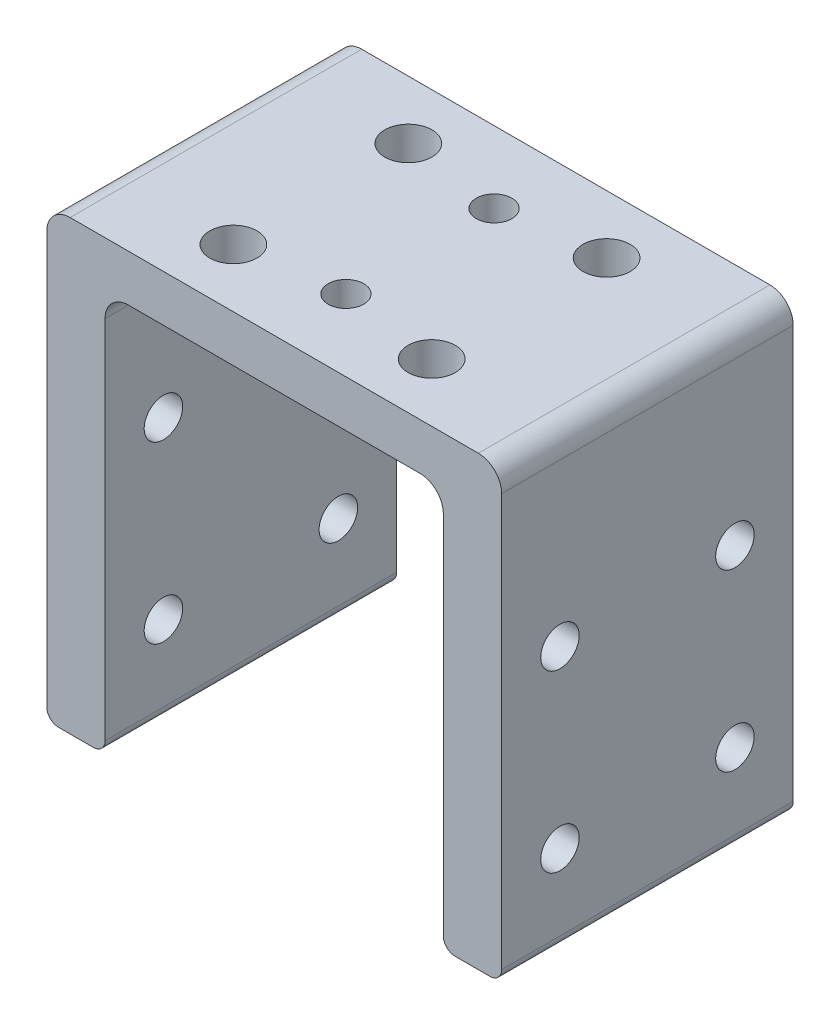
ISO-10303-21;
HEADER;
FILE_DESCRIPTION(('STEP AP214'),'2;1');
FILE_NAME('part.step','',(''),(''),'','','');
FILE_SCHEMA(('AUTOMOTIVE_DESIGN { 1 0 10303 214 1 1 1 1 }'));
ENDSEC;
DATA;
#1=APPLICATION_CONTEXT('core data for automotive mechanical design processes');
#2=APPLICATION_PROTOCOL_DEFINITION('international standard','automotive_design',2000,#1);
#3=PRODUCT_CONTEXT('',#1,'mechanical');
#4=PRODUCT('Part','Part','',(#3));
#5=PRODUCT_RELATED_PRODUCT_CATEGORY('part','',(#4));
#6=PRODUCT_DEFINITION_FORMATION('','',#4);
#7=PRODUCT_DEFINITION_CONTEXT('part definition',#1,'design');
#8=PRODUCT_DEFINITION('design','',#6,#7);
#9=PRODUCT_DEFINITION_SHAPE('','',#8);
#10=(LENGTH_UNIT() NAMED_UNIT(*) SI_UNIT(.MILLI.,.METRE.));
#11=(NAMED_UNIT(*) PLANE_ANGLE_UNIT() SI_UNIT($,.RADIAN.));
#12=(NAMED_UNIT(*) SI_UNIT($,.STERADIAN.) SOLID_ANGLE_UNIT());
#13=UNCERTAINTY_MEASURE_WITH_UNIT(LENGTH_MEASURE(1.E-05),#10,'distance_accuracy_value','');
#14=(GEOMETRIC_REPRESENTATION_CONTEXT(3) GLOBAL_UNCERTAINTY_ASSIGNED_CONTEXT((#13)) GLOBAL_UNIT_ASSIGNED_CONTEXT((#10,
#11,#12)) REPRESENTATION_CONTEXT('',''));
#15=CARTESIAN_POINT('',(0.,0.,0.));
#16=DIRECTION('',(0.,0.,1.));
#17=DIRECTION('',(1.,0.,0.));
#18=AXIS2_PLACEMENT_3D('',#15,#16,#17);
#19=CARTESIAN_POINT('',(19.5,-24.5,25.));
#20=DIRECTION('',(-1.,0.,0.));
#21=DIRECTION('',(0.,0.,1.));
#22=AXIS2_PLACEMENT_3D('',#19,#20,#21);
#23=PLANE('',#22);
#24=CARTESIAN_POINT('',(19.5,8.65000000000001,5.));
#25=DIRECTION('',(-1.,0.,0.));
#26=DIRECTION('',(0.,0.,1.));
#27=AXIS2_PLACEMENT_3D('',#24,#25,#26);
#28=CIRCLE('',#27,1.64999999999999);
#29=CARTESIAN_POINT('',(19.5,8.65000000000001,6.64999999999999));
#30=VERTEX_POINT('',#29);
#31=EDGE_CURVE('E250',#30,#30,#28,.T.);
#32=ORIENTED_EDGE('',*,*,#31,.T.);
#33=EDGE_LOOP('',(#32));
#34=FACE_BOUND('',#33,.T.);
#35=CARTESIAN_POINT('',(19.5,8.65000000000001,20.));
#36=DIRECTION('',(-1.,0.,0.));
#37=DIRECTION('',(0.,0.,1.));
#38=AXIS2_PLACEMENT_3D('',#35,#36,#37);
#39=CIRCLE('',#38,1.64999999999999);
#40=CARTESIAN_POINT('',(19.5,8.65000000000001,21.65));
#41=VERTEX_POINT('',#40);
#42=EDGE_CURVE('E244',#41,#41,#39,.T.);
#43=ORIENTED_EDGE('',*,*,#42,.T.);
#44=EDGE_LOOP('',(#43));
#45=FACE_BOUND('',#44,.T.);
#46=CARTESIAN_POINT('',(19.5,-6.34999999999999,20.));
#47=DIRECTION('',(-1.,0.,0.));
#48=DIRECTION('',(0.,0.,1.));
#49=AXIS2_PLACEMENT_3D('',#46,#47,#48);
#50=CIRCLE('',#49,1.64999999999999);
#51=CARTESIAN_POINT('',(19.5,-6.34999999999999,21.65));
#52=VERTEX_POINT('',#51);
#53=EDGE_CURVE('E238',#52,#52,#50,.T.);
#54=ORIENTED_EDGE('',*,*,#53,.T.);
#55=EDGE_LOOP('',(#54));
#56=FACE_BOUND('',#55,.T.);
#57=CARTESIAN_POINT('',(19.5,-6.34999999999999,5.));
#58=DIRECTION('',(-1.,0.,0.));
#59=DIRECTION('',(0.,0.,1.));
#60=AXIS2_PLACEMENT_3D('',#57,#58,#59);
#61=CIRCLE('',#60,1.64999999999999);
#62=CARTESIAN_POINT('',(19.5,-6.34999999999999,6.64999999999999));
#63=VERTEX_POINT('',#62);
#64=EDGE_CURVE('E232',#63,#63,#61,.T.);
#65=ORIENTED_EDGE('',*,*,#64,.T.);
#66=EDGE_LOOP('',(#65));
#67=FACE_BOUND('',#66,.T.);
#68=DIRECTION('',(0.,1.,0.));
#69=VECTOR('',#68,1.);
#70=CARTESIAN_POINT('',(19.5,-24.5,25.));
#71=LINE('',#70,#69);
#72=CARTESIAN_POINT('',(19.5,-12.85,25.));
#73=VERTEX_POINT('',#72);
#74=CARTESIAN_POINT('',(19.5,22.5,25.));
#75=VERTEX_POINT('',#74);
#76=EDGE_CURVE('E206',#73,#75,#71,.T.);
#77=ORIENTED_EDGE('',*,*,#76,.F.);
#78=DIRECTION('',(0.,0.,1.));
#79=VECTOR('',#78,1.);
#80=CARTESIAN_POINT('',(19.5,-12.85,25.));
#81=LINE('',#80,#79);
#82=CARTESIAN_POINT('',(19.5,-12.85,0.));
#83=VERTEX_POINT('',#82);
#84=EDGE_CURVE('E11',#73,#83,#81,.F.);
#85=ORIENTED_EDGE('',*,*,#84,.T.);
#86=DIRECTION('',(0.,1.,0.));
#87=VECTOR('',#86,1.);
#88=CARTESIAN_POINT('',(19.5,-24.5,0.));
#89=LINE('',#88,#87);
#90=CARTESIAN_POINT('',(19.5,22.5,0.));
#91=VERTEX_POINT('',#90);
#92=EDGE_CURVE('E217',#83,#91,#89,.T.);
#93=ORIENTED_EDGE('',*,*,#92,.T.);
#94=DIRECTION('',(0.,0.,-1.));
#95=VECTOR('',#94,1.);
#96=CARTESIAN_POINT('',(19.5,22.5,25.));
#97=LINE('',#96,#95);
#98=EDGE_CURVE('E273',#91,#75,#97,.F.);
#99=ORIENTED_EDGE('',*,*,#98,.T.);
#100=EDGE_LOOP('',(#77,#85,#93,#99));
#101=FACE_BOUND('',#100,.T.);
#102=ADVANCED_FACE('F44',(#34,#45,#56,#67,#101),#23,.F.);
#103=CARTESIAN_POINT('',(-19.5,24.5,25.));
#104=DIRECTION('',(0.,-1.,0.));
#105=DIRECTION('',(0.,0.,-1.));
#106=AXIS2_PLACEMENT_3D('',#103,#104,#105);
#107=PLANE('',#106);
#108=CARTESIAN_POINT('',(0.,24.5,6.15));
#109=DIRECTION('',(0.,1.,0.));
#110=DIRECTION('',(0.,0.,1.));
#111=AXIS2_PLACEMENT_3D('',#108,#109,#110);
#112=CIRCLE('',#111,1.525);
#113=CARTESIAN_POINT('',(0.,24.5,7.675));
#114=VERTEX_POINT('',#113);
#115=EDGE_CURVE('E340',#114,#114,#112,.T.);
#116=ORIENTED_EDGE('',*,*,#115,.F.);
#117=EDGE_LOOP('',(#116));
#118=FACE_BOUND('',#117,.T.);
#119=CARTESIAN_POINT('',(0.,24.5,18.85));
#120=DIRECTION('',(0.,1.,0.));
#121=DIRECTION('',(0.,0.,1.));
#122=AXIS2_PLACEMENT_3D('',#119,#120,#121);
#123=CIRCLE('',#122,1.525);
#124=CARTESIAN_POINT('',(0.,24.5,20.375));
#125=VERTEX_POINT('',#124);
#126=EDGE_CURVE('E350',#125,#125,#123,.T.);
#127=ORIENTED_EDGE('',*,*,#126,.F.);
#128=EDGE_LOOP('',(#127));
#129=FACE_BOUND('',#128,.T.);
#130=CARTESIAN_POINT('',(8.49999999999999,24.5,20.));
#131=DIRECTION('',(0.,-1.,0.));
#132=DIRECTION('',(0.,0.,-1.));
#133=AXIS2_PLACEMENT_3D('',#130,#131,#132);
#134=CIRCLE('',#133,2.025);
#135=CARTESIAN_POINT('',(8.49999999999999,24.5,17.975));
#136=VERTEX_POINT('',#135);
#137=EDGE_CURVE('E387',#136,#136,#134,.T.);
#138=ORIENTED_EDGE('',*,*,#137,.T.);
#139=EDGE_LOOP('',(#138));
#140=FACE_BOUND('',#139,.T.);
#141=CARTESIAN_POINT('',(8.49999999999999,24.5,5.));
#142=DIRECTION('',(0.,-1.,0.));
#143=DIRECTION('',(0.,0.,-1.));
#144=AXIS2_PLACEMENT_3D('',#141,#142,#143);
#145=CIRCLE('',#144,2.025);
#146=CARTESIAN_POINT('',(8.49999999999999,24.5,2.975));
#147=VERTEX_POINT('',#146);
#148=EDGE_CURVE('E383',#147,#147,#145,.T.);
#149=ORIENTED_EDGE('',*,*,#148,.T.);
#150=EDGE_LOOP('',(#149));
#151=FACE_BOUND('',#150,.T.);
#152=CARTESIAN_POINT('',(-8.50000000000001,24.5,5.));
#153=DIRECTION('',(0.,-1.,0.));
#154=DIRECTION('',(0.,0.,-1.));
#155=AXIS2_PLACEMENT_3D('',#152,#153,#154);
#156=CIRCLE('',#155,2.025);
#157=CARTESIAN_POINT('',(-8.50000000000001,24.5,2.975));
#158=VERTEX_POINT('',#157);
#159=EDGE_CURVE('E379',#158,#158,#156,.T.);
#160=ORIENTED_EDGE('',*,*,#159,.T.);
#161=EDGE_LOOP('',(#160));
#162=FACE_BOUND('',#161,.T.);
#163=CARTESIAN_POINT('',(-8.50000000000001,24.5,20.));
#164=DIRECTION('',(0.,-1.,0.));
#165=DIRECTION('',(0.,0.,-1.));
#166=AXIS2_PLACEMENT_3D('',#163,#164,#165);
#167=CIRCLE('',#166,2.025);
#168=CARTESIAN_POINT('',(-8.50000000000001,24.5,17.975));
#169=VERTEX_POINT('',#168);
#170=EDGE_CURVE('E375',#169,#169,#167,.T.);
#171=ORIENTED_EDGE('',*,*,#170,.T.);
#172=EDGE_LOOP('',(#171));
#173=FACE_BOUND('',#172,.T.);
#174=DIRECTION('',(-1.,0.,0.));
#175=VECTOR('',#174,1.);
#176=CARTESIAN_POINT('',(-19.5,24.5,25.));
#177=LINE('',#176,#175);
#178=CARTESIAN_POINT('',(17.5,24.5,25.));
#179=VERTEX_POINT('',#178);
#180=CARTESIAN_POINT('',(-17.5,24.5,25.));
#181=VERTEX_POINT('',#180);
#182=EDGE_CURVE('E209',#179,#181,#177,.T.);
#183=ORIENTED_EDGE('',*,*,#182,.F.);
#184=DIRECTION('',(0.,0.,-1.));
#185=VECTOR('',#184,1.);
#186=CARTESIAN_POINT('',(17.5,24.5,25.));
#187=LINE('',#186,#185);
#188=CARTESIAN_POINT('',(17.5,24.5,0.));
#189=VERTEX_POINT('',#188);
#190=EDGE_CURVE('E262',#179,#189,#187,.T.);
#191=ORIENTED_EDGE('',*,*,#190,.T.);
#192=DIRECTION('',(-1.,0.,0.));
#193=VECTOR('',#192,1.);
#194=CARTESIAN_POINT('',(-19.5,24.5,0.));
#195=LINE('',#194,#193);
#196=CARTESIAN_POINT('',(-17.5,24.5,0.));
#197=VERTEX_POINT('',#196);
#198=EDGE_CURVE('E220',#189,#197,#195,.T.);
#199=ORIENTED_EDGE('',*,*,#198,.T.);
#200=DIRECTION('',(0.,0.,-1.));
#201=VECTOR('',#200,1.);
#202=CARTESIAN_POINT('',(-17.5,24.5,25.));
#203=LINE('',#202,#201);
#204=EDGE_CURVE('E259',#197,#181,#203,.F.);
#205=ORIENTED_EDGE('',*,*,#204,.T.);
#206=EDGE_LOOP('',(#183,#191,#199,#205));
#207=FACE_BOUND('',#206,.T.);
#208=ADVANCED_FACE('F479',(#118,#129,#140,#151,#162,#173,#207),#107,.F.);
#209=CARTESIAN_POINT('',(-19.5,-24.5,25.));
#210=DIRECTION('',(1.,0.,0.));
#211=DIRECTION('',(0.,0.,-1.));
#212=AXIS2_PLACEMENT_3D('',#209,#210,#211);
#213=PLANE('',#212);
#214=CARTESIAN_POINT('',(-19.5,8.65000000000001,5.));
#215=DIRECTION('',(-1.,0.,0.));
#216=DIRECTION('',(0.,0.,1.));
#217=AXIS2_PLACEMENT_3D('',#214,#215,#216);
#218=CIRCLE('',#217,1.64999999999999);
#219=CARTESIAN_POINT('',(-19.5,8.65000000000001,6.64999999999999));
#220=VERTEX_POINT('',#219);
#221=EDGE_CURVE('E395',#220,#220,#218,.T.);
#222=ORIENTED_EDGE('',*,*,#221,.F.);
#223=EDGE_LOOP('',(#222));
#224=FACE_BOUND('',#223,.T.);
#225=CARTESIAN_POINT('',(-19.5,8.65000000000001,20.));
#226=DIRECTION('',(-1.,0.,0.));
#227=DIRECTION('',(0.,0.,1.));
#228=AXIS2_PLACEMENT_3D('',#225,#226,#227);
#229=CIRCLE('',#228,1.64999999999999);
#230=CARTESIAN_POINT('',(-19.5,8.65000000000001,21.65));
#231=VERTEX_POINT('',#230);
#232=EDGE_CURVE('E410',#231,#231,#229,.T.);
#233=ORIENTED_EDGE('',*,*,#232,.F.);
#234=EDGE_LOOP('',(#233));
#235=FACE_BOUND('',#234,.T.);
#236=CARTESIAN_POINT('',(-19.5,-6.34999999999999,20.));
#237=DIRECTION('',(-1.,0.,0.));
#238=DIRECTION('',(0.,0.,1.));
#239=AXIS2_PLACEMENT_3D('',#236,#237,#238);
#240=CIRCLE('',#239,1.64999999999999);
#241=CARTESIAN_POINT('',(-19.5,-6.34999999999999,21.65));
#242=VERTEX_POINT('',#241);
#243=EDGE_CURVE('E420',#242,#242,#240,.T.);
#244=ORIENTED_EDGE('',*,*,#243,.F.);
#245=EDGE_LOOP('',(#244));
#246=FACE_BOUND('',#245,.T.);
#247=CARTESIAN_POINT('',(-19.5,-6.34999999999999,5.));
#248=DIRECTION('',(-1.,0.,0.));
#249=DIRECTION('',(0.,0.,1.));
#250=AXIS2_PLACEMENT_3D('',#247,#248,#249);
#251=CIRCLE('',#250,1.64999999999999);
#252=CARTESIAN_POINT('',(-19.5,-6.34999999999999,6.64999999999999));
#253=VERTEX_POINT('',#252);
#254=EDGE_CURVE('E430',#253,#253,#251,.T.);
#255=ORIENTED_EDGE('',*,*,#254,.F.);
#256=EDGE_LOOP('',(#255));
#257=FACE_BOUND('',#256,.T.);
#258=DIRECTION('',(0.,-1.,0.));
#259=VECTOR('',#258,1.);
#260=CARTESIAN_POINT('',(-19.5,-24.5,0.));
#261=LINE('',#260,#259);
#262=CARTESIAN_POINT('',(-19.5,22.5,0.));
#263=VERTEX_POINT('',#262);
#264=CARTESIAN_POINT('',(-19.5,-12.85,0.));
#265=VERTEX_POINT('',#264);
#266=EDGE_CURVE('E210',#263,#265,#261,.T.);
#267=ORIENTED_EDGE('',*,*,#266,.T.);
#268=DIRECTION('',(0.,0.,1.));
#269=VECTOR('',#268,1.);
#270=CARTESIAN_POINT('',(-19.5,-12.85,25.));
#271=LINE('',#270,#269);
#272=CARTESIAN_POINT('',(-19.5,-12.85,25.));
#273=VERTEX_POINT('',#272);
#274=EDGE_CURVE('E293',#265,#273,#271,.T.);
#275=ORIENTED_EDGE('',*,*,#274,.T.);
#276=DIRECTION('',(0.,-1.,0.));
#277=VECTOR('',#276,1.);
#278=CARTESIAN_POINT('',(-19.5,-24.5,25.));
#279=LINE('',#278,#277);
#280=CARTESIAN_POINT('',(-19.5,22.5,25.));
#281=VERTEX_POINT('',#280);
#282=EDGE_CURVE('E214',#281,#273,#279,.T.);
#283=ORIENTED_EDGE('',*,*,#282,.F.);
#284=DIRECTION('',(0.,0.,-1.));
#285=VECTOR('',#284,1.);
#286=CARTESIAN_POINT('',(-19.5,22.5,25.));
#287=LINE('',#286,#285);
#288=EDGE_CURVE('E174',#281,#263,#287,.T.);
#289=ORIENTED_EDGE('',*,*,#288,.T.);
#290=EDGE_LOOP('',(#267,#275,#283,#289));
#291=FACE_BOUND('',#290,.T.);
#292=ADVANCED_FACE('F485',(#224,#235,#246,#257,#291),#213,.F.);
#293=CARTESIAN_POINT('',(0.,0.,25.));
#294=DIRECTION('',(0.,0.,-1.));
#295=DIRECTION('',(-1.,0.,0.));
#296=AXIS2_PLACEMENT_3D('',#293,#294,#295);
#297=PLANE('',#296);
#298=ORIENTED_EDGE('',*,*,#282,.T.);
#299=CARTESIAN_POINT('',(-18.5,-12.85,25.));
#300=DIRECTION('',(0.,0.,-1.));
#301=DIRECTION('',(-1.,0.,0.));
#302=AXIS2_PLACEMENT_3D('',#299,#300,#301);
#303=CIRCLE('',#302,1.);
#304=CARTESIAN_POINT('',(-18.5,-13.85,25.));
#305=VERTEX_POINT('',#304);
#306=EDGE_CURVE('E306',#273,#305,#303,.F.);
#307=ORIENTED_EDGE('',*,*,#306,.T.);
#308=DIRECTION('',(-1.,0.,0.));
#309=VECTOR('',#308,1.);
#310=CARTESIAN_POINT('',(-19.5,-13.85,25.));
#311=LINE('',#310,#309);
#312=CARTESIAN_POINT('',(-15.5,-13.85,25.));
#313=VERTEX_POINT('',#312);
#314=EDGE_CURVE('E391',#313,#305,#311,.T.);
#315=ORIENTED_EDGE('',*,*,#314,.F.);
#316=CARTESIAN_POINT('',(-15.5,-12.85,25.));
#317=DIRECTION('',(0.,0.,-1.));
#318=DIRECTION('',(-1.,0.,0.));
#319=AXIS2_PLACEMENT_3D('',#316,#317,#318);
#320=CIRCLE('',#319,1.);
#321=CARTESIAN_POINT('',(-14.5,-12.85,25.));
#322=VERTEX_POINT('',#321);
#323=EDGE_CURVE('E303',#313,#322,#320,.F.);
#324=ORIENTED_EDGE('',*,*,#323,.T.);
#325=DIRECTION('',(0.,-1.,0.));
#326=VECTOR('',#325,1.);
#327=CARTESIAN_POINT('',(-14.5,-24.5,25.));
#328=LINE('',#327,#326);
#329=CARTESIAN_POINT('',(-14.5,18.5,25.));
#330=VERTEX_POINT('',#329);
#331=EDGE_CURVE('E192',#330,#322,#328,.T.);
#332=ORIENTED_EDGE('',*,*,#331,.F.);
#333=CARTESIAN_POINT('',(-12.5,18.5,25.));
#334=DIRECTION('',(0.,0.,-1.));
#335=DIRECTION('',(-1.,0.,0.));
#336=AXIS2_PLACEMENT_3D('',#333,#334,#335);
#337=CIRCLE('',#336,2.);
#338=CARTESIAN_POINT('',(-12.5,20.5,25.));
#339=VERTEX_POINT('',#338);
#340=EDGE_CURVE('E190',#330,#339,#337,.T.);
#341=ORIENTED_EDGE('',*,*,#340,.T.);
#342=DIRECTION('',(-1.,0.,0.));
#343=VECTOR('',#342,1.);
#344=CARTESIAN_POINT('',(-14.5,20.5,25.));
#345=LINE('',#344,#343);
#346=CARTESIAN_POINT('',(12.5,20.5,25.));
#347=VERTEX_POINT('',#346);
#348=EDGE_CURVE('E180',#347,#339,#345,.T.);
#349=ORIENTED_EDGE('',*,*,#348,.F.);
#350=CARTESIAN_POINT('',(12.5,18.5,25.));
#351=DIRECTION('',(0.,0.,-1.));
#352=DIRECTION('',(-1.,0.,0.));
#353=AXIS2_PLACEMENT_3D('',#350,#351,#352);
#354=CIRCLE('',#353,2.);
#355=CARTESIAN_POINT('',(14.5,18.5,25.));
#356=VERTEX_POINT('',#355);
#357=EDGE_CURVE('E162',#347,#356,#354,.T.);
#358=ORIENTED_EDGE('',*,*,#357,.T.);
#359=DIRECTION('',(0.,1.,0.));
#360=VECTOR('',#359,1.);
#361=CARTESIAN_POINT('',(14.5,20.5,25.));
#362=LINE('',#361,#360);
#363=CARTESIAN_POINT('',(14.5,-12.85,25.));
#364=VERTEX_POINT('',#363);
#365=EDGE_CURVE('E193',#364,#356,#362,.T.);
#366=ORIENTED_EDGE('',*,*,#365,.F.);
#367=CARTESIAN_POINT('',(15.5,-12.85,25.));
#368=DIRECTION('',(0.,0.,-1.));
#369=DIRECTION('',(-1.,0.,0.));
#370=AXIS2_PLACEMENT_3D('',#367,#368,#369);
#371=CIRCLE('',#370,1.);
#372=CARTESIAN_POINT('',(15.5,-13.85,25.));
#373=VERTEX_POINT('',#372);
#374=EDGE_CURVE('E300',#364,#373,#371,.F.);
#375=ORIENTED_EDGE('',*,*,#374,.T.);
#376=CARTESIAN_POINT('',(18.5,-13.85,25.));
#377=VERTEX_POINT('',#376);
#378=EDGE_CURVE('E397',#377,#373,#311,.T.);
#379=ORIENTED_EDGE('',*,*,#378,.F.);
#380=CARTESIAN_POINT('',(18.5,-12.85,25.));
#381=DIRECTION('',(0.,0.,-1.));
#382=DIRECTION('',(-1.,0.,0.));
#383=AXIS2_PLACEMENT_3D('',#380,#381,#382);
#384=CIRCLE('',#383,1.);
#385=EDGE_CURVE('E297',#377,#73,#384,.F.);
#386=ORIENTED_EDGE('',*,*,#385,.T.);
#387=ORIENTED_EDGE('',*,*,#76,.T.);
#388=CARTESIAN_POINT('',(17.5,22.5,25.));
#389=DIRECTION('',(0.,0.,-1.));
#390=DIRECTION('',(-1.,0.,0.));
#391=AXIS2_PLACEMENT_3D('',#388,#389,#390);
#392=CIRCLE('',#391,2.);
#393=EDGE_CURVE('E280',#75,#179,#392,.F.);
#394=ORIENTED_EDGE('',*,*,#393,.T.);
#395=ORIENTED_EDGE('',*,*,#182,.T.);
#396=CARTESIAN_POINT('',(-17.5,22.5,25.));
#397=DIRECTION('',(0.,0.,-1.));
#398=DIRECTION('',(-1.,0.,0.));
#399=AXIS2_PLACEMENT_3D('',#396,#397,#398);
#400=CIRCLE('',#399,2.);
#401=EDGE_CURVE('E277',#181,#281,#400,.F.);
#402=ORIENTED_EDGE('',*,*,#401,.T.);
#403=EDGE_LOOP('',(#298,#307,#315,#324,#332,#341,#349,#358,#366,#375,#379,#386,#387,#394,#395,#402));
#404=FACE_BOUND('',#403,.T.);
#405=ADVANCED_FACE('F188',(#404),#297,.F.);
#406=CARTESIAN_POINT('',(0.,0.,0.));
#407=DIRECTION('',(0.,0.,-1.));
#408=DIRECTION('',(-1.,0.,0.));
#409=AXIS2_PLACEMENT_3D('',#406,#407,#408);
#410=PLANE('',#409);
#411=DIRECTION('',(-1.,0.,0.));
#412=VECTOR('',#411,1.);
#413=CARTESIAN_POINT('',(-19.5,-13.85,0.));
#414=LINE('',#413,#412);
#415=CARTESIAN_POINT('',(-15.5,-13.85,0.));
#416=VERTEX_POINT('',#415);
#417=CARTESIAN_POINT('',(-18.5,-13.85,0.));
#418=VERTEX_POINT('',#417);
#419=EDGE_CURVE('E396',#416,#418,#414,.T.);
#420=ORIENTED_EDGE('',*,*,#419,.T.);
#421=CARTESIAN_POINT('',(-18.5,-12.85,0.));
#422=DIRECTION('',(0.,0.,-1.));
#423=DIRECTION('',(-1.,0.,0.));
#424=AXIS2_PLACEMENT_3D('',#421,#422,#423);
#425=CIRCLE('',#424,1.);
#426=EDGE_CURVE('E322',#418,#265,#425,.T.);
#427=ORIENTED_EDGE('',*,*,#426,.T.);
#428=ORIENTED_EDGE('',*,*,#266,.F.);
#429=CARTESIAN_POINT('',(-17.5,22.5,0.));
#430=DIRECTION('',(0.,0.,-1.));
#431=DIRECTION('',(-1.,0.,0.));
#432=AXIS2_PLACEMENT_3D('',#429,#430,#431);
#433=CIRCLE('',#432,2.);
#434=EDGE_CURVE('E266',#263,#197,#433,.T.);
#435=ORIENTED_EDGE('',*,*,#434,.T.);
#436=ORIENTED_EDGE('',*,*,#198,.F.);
#437=CARTESIAN_POINT('',(17.5,22.5,0.));
#438=DIRECTION('',(0.,0.,-1.));
#439=DIRECTION('',(-1.,0.,0.));
#440=AXIS2_PLACEMENT_3D('',#437,#438,#439);
#441=CIRCLE('',#440,2.);
#442=EDGE_CURVE('E269',#189,#91,#441,.T.);
#443=ORIENTED_EDGE('',*,*,#442,.T.);
#444=ORIENTED_EDGE('',*,*,#92,.F.);
#445=CARTESIAN_POINT('',(18.5,-12.85,0.));
#446=DIRECTION('',(0.,0.,-1.));
#447=DIRECTION('',(-1.,0.,0.));
#448=AXIS2_PLACEMENT_3D('',#445,#446,#447);
#449=CIRCLE('',#448,1.);
#450=CARTESIAN_POINT('',(18.5,-13.85,0.));
#451=VERTEX_POINT('',#450);
#452=EDGE_CURVE('E315',#83,#451,#449,.T.);
#453=ORIENTED_EDGE('',*,*,#452,.T.);
#454=CARTESIAN_POINT('',(15.5,-13.85,0.));
#455=VERTEX_POINT('',#454);
#456=EDGE_CURVE('E392',#451,#455,#414,.T.);
#457=ORIENTED_EDGE('',*,*,#456,.T.);
#458=CARTESIAN_POINT('',(15.5,-12.85,0.));
#459=DIRECTION('',(0.,0.,-1.));
#460=DIRECTION('',(-1.,0.,0.));
#461=AXIS2_PLACEMENT_3D('',#458,#459,#460);
#462=CIRCLE('',#461,1.);
#463=CARTESIAN_POINT('',(14.5,-12.85,0.));
#464=VERTEX_POINT('',#463);
#465=EDGE_CURVE('E70',#455,#464,#462,.T.);
#466=ORIENTED_EDGE('',*,*,#465,.T.);
#467=DIRECTION('',(0.,1.,0.));
#468=VECTOR('',#467,1.);
#469=CARTESIAN_POINT('',(14.5,20.5,0.));
#470=LINE('',#469,#468);
#471=CARTESIAN_POINT('',(14.5,18.5,0.));
#472=VERTEX_POINT('',#471);
#473=EDGE_CURVE('E200',#464,#472,#470,.T.);
#474=ORIENTED_EDGE('',*,*,#473,.T.);
#475=CARTESIAN_POINT('',(12.5,18.5,0.));
#476=DIRECTION('',(0.,0.,-1.));
#477=DIRECTION('',(-1.,0.,0.));
#478=AXIS2_PLACEMENT_3D('',#475,#476,#477);
#479=CIRCLE('',#478,2.);
#480=CARTESIAN_POINT('',(12.5,20.5,0.));
#481=VERTEX_POINT('',#480);
#482=EDGE_CURVE('E173',#472,#481,#479,.F.);
#483=ORIENTED_EDGE('',*,*,#482,.T.);
#484=DIRECTION('',(-1.,0.,0.));
#485=VECTOR('',#484,1.);
#486=CARTESIAN_POINT('',(-14.5,20.5,0.));
#487=LINE('',#486,#485);
#488=CARTESIAN_POINT('',(-12.5,20.5,0.));
#489=VERTEX_POINT('',#488);
#490=EDGE_CURVE('E183',#481,#489,#487,.T.);
#491=ORIENTED_EDGE('',*,*,#490,.T.);
#492=CARTESIAN_POINT('',(-12.5,18.5,0.));
#493=DIRECTION('',(0.,0.,-1.));
#494=DIRECTION('',(-1.,0.,0.));
#495=AXIS2_PLACEMENT_3D('',#492,#493,#494);
#496=CIRCLE('',#495,2.);
#497=CARTESIAN_POINT('',(-14.5,18.5,0.));
#498=VERTEX_POINT('',#497);
#499=EDGE_CURVE('E290',#489,#498,#496,.F.);
#500=ORIENTED_EDGE('',*,*,#499,.T.);
#501=DIRECTION('',(0.,-1.,0.));
#502=VECTOR('',#501,1.);
#503=CARTESIAN_POINT('',(-14.5,-24.5,0.));
#504=LINE('',#503,#502);
#505=CARTESIAN_POINT('',(-14.5,-12.85,0.));
#506=VERTEX_POINT('',#505);
#507=EDGE_CURVE('E221',#498,#506,#504,.T.);
#508=ORIENTED_EDGE('',*,*,#507,.T.);
#509=CARTESIAN_POINT('',(-15.5,-12.85,0.));
#510=DIRECTION('',(0.,0.,-1.));
#511=DIRECTION('',(-1.,0.,0.));
#512=AXIS2_PLACEMENT_3D('',#509,#510,#511);
#513=CIRCLE('',#512,1.);
#514=EDGE_CURVE('E62',#506,#416,#513,.T.);
#515=ORIENTED_EDGE('',*,*,#514,.T.);
#516=EDGE_LOOP('',(#420,#427,#428,#435,#436,#443,#444,#453,#457,#466,#474,#483,#491,#500,#508,#515));
#517=FACE_BOUND('',#516,.T.);
#518=ADVANCED_FACE('F449',(#517),#410,.T.);
#519=CARTESIAN_POINT('',(-14.5,-24.5,0.));
#520=DIRECTION('',(-1.,0.,0.));
#521=DIRECTION('',(0.,0.,1.));
#522=AXIS2_PLACEMENT_3D('',#519,#520,#521);
#523=PLANE('',#522);
#524=CARTESIAN_POINT('',(-14.5,8.65000000000001,5.));
#525=DIRECTION('',(-1.,0.,0.));
#526=DIRECTION('',(0.,0.,1.));
#527=AXIS2_PLACEMENT_3D('',#524,#525,#526);
#528=CIRCLE('',#527,1.64999999999999);
#529=CARTESIAN_POINT('',(-14.5,8.65000000000001,6.64999999999999));
#530=VERTEX_POINT('',#529);
#531=EDGE_CURVE('E245',#530,#530,#528,.T.);
#532=ORIENTED_EDGE('',*,*,#531,.T.);
#533=EDGE_LOOP('',(#532));
#534=FACE_BOUND('',#533,.T.);
#535=CARTESIAN_POINT('',(-14.5,8.65000000000001,20.));
#536=DIRECTION('',(-1.,0.,0.));
#537=DIRECTION('',(0.,0.,1.));
#538=AXIS2_PLACEMENT_3D('',#535,#536,#537);
#539=CIRCLE('',#538,1.64999999999999);
#540=CARTESIAN_POINT('',(-14.5,8.65000000000001,21.65));
#541=VERTEX_POINT('',#540);
#542=EDGE_CURVE('E243',#541,#541,#539,.T.);
#543=ORIENTED_EDGE('',*,*,#542,.T.);
#544=EDGE_LOOP('',(#543));
#545=FACE_BOUND('',#544,.T.);
#546=CARTESIAN_POINT('',(-14.5,-6.34999999999999,20.));
#547=DIRECTION('',(-1.,0.,0.));
#548=DIRECTION('',(0.,0.,1.));
#549=AXIS2_PLACEMENT_3D('',#546,#547,#548);
#550=CIRCLE('',#549,1.64999999999999);
#551=CARTESIAN_POINT('',(-14.5,-6.34999999999999,21.65));
#552=VERTEX_POINT('',#551);
#553=EDGE_CURVE('E237',#552,#552,#550,.T.);
#554=ORIENTED_EDGE('',*,*,#553,.T.);
#555=EDGE_LOOP('',(#554));
#556=FACE_BOUND('',#555,.T.);
#557=CARTESIAN_POINT('',(-14.5,-6.34999999999999,5.));
#558=DIRECTION('',(-1.,0.,0.));
#559=DIRECTION('',(0.,0.,1.));
#560=AXIS2_PLACEMENT_3D('',#557,#558,#559);
#561=CIRCLE('',#560,1.64999999999999);
#562=CARTESIAN_POINT('',(-14.5,-6.34999999999999,6.64999999999999));
#563=VERTEX_POINT('',#562);
#564=EDGE_CURVE('E202',#563,#563,#561,.T.);
#565=ORIENTED_EDGE('',*,*,#564,.T.);
#566=EDGE_LOOP('',(#565));
#567=FACE_BOUND('',#566,.T.);
#568=ORIENTED_EDGE('',*,*,#331,.T.);
#569=DIRECTION('',(0.,0.,-1.));
#570=VECTOR('',#569,1.);
#571=CARTESIAN_POINT('',(-14.5,-12.85,0.));
#572=LINE('',#571,#570);
#573=EDGE_CURVE('E325',#322,#506,#572,.T.);
#574=ORIENTED_EDGE('',*,*,#573,.T.);
#575=ORIENTED_EDGE('',*,*,#507,.F.);
#576=DIRECTION('',(0.,0.,1.));
#577=VECTOR('',#576,1.);
#578=CARTESIAN_POINT('',(-14.5,18.5,25.));
#579=LINE('',#578,#577);
#580=EDGE_CURVE('E255',#498,#330,#579,.T.);
#581=ORIENTED_EDGE('',*,*,#580,.T.);
#582=EDGE_LOOP('',(#568,#574,#575,#581));
#583=FACE_BOUND('',#582,.T.);
#584=ADVANCED_FACE('F454',(#534,#545,#556,#567,#583),#523,.F.);
#585=CARTESIAN_POINT('',(-14.5,20.5,0.));
#586=DIRECTION('',(0.,1.,0.));
#587=DIRECTION('',(-1.,0.,0.));
#588=AXIS2_PLACEMENT_3D('',#585,#586,#587);
#589=PLANE('',#588);
#590=CARTESIAN_POINT('',(0.,20.5,6.15));
#591=DIRECTION('',(0.,1.,0.));
#592=DIRECTION('',(-1.,0.,0.));
#593=AXIS2_PLACEMENT_3D('',#590,#591,#592);
#594=CIRCLE('',#593,1.525);
#595=CARTESIAN_POINT('',(-1.525,20.5,6.15));
#596=VERTEX_POINT('',#595);
#597=EDGE_CURVE('E48',#596,#596,#594,.T.);
#598=ORIENTED_EDGE('',*,*,#597,.T.);
#599=EDGE_LOOP('',(#598));
#600=FACE_BOUND('',#599,.T.);
#601=CARTESIAN_POINT('',(0.,20.5,18.85));
#602=DIRECTION('',(0.,1.,0.));
#603=DIRECTION('',(-1.,0.,0.));
#604=AXIS2_PLACEMENT_3D('',#601,#602,#603);
#605=CIRCLE('',#604,1.525);
#606=CARTESIAN_POINT('',(-1.525,20.5,18.85));
#607=VERTEX_POINT('',#606);
#608=EDGE_CURVE('E337',#607,#607,#605,.T.);
#609=ORIENTED_EDGE('',*,*,#608,.T.);
#610=EDGE_LOOP('',(#609));
#611=FACE_BOUND('',#610,.T.);
#612=CARTESIAN_POINT('',(8.49999999999999,20.5,20.));
#613=DIRECTION('',(0.,-1.,0.));
#614=DIRECTION('',(1.,0.,0.));
#615=AXIS2_PLACEMENT_3D('',#612,#613,#614);
#616=CIRCLE('',#615,2.025);
#617=CARTESIAN_POINT('',(10.525,20.5,20.));
#618=VERTEX_POINT('',#617);
#619=EDGE_CURVE('E348',#618,#618,#616,.T.);
#620=ORIENTED_EDGE('',*,*,#619,.F.);
#621=EDGE_LOOP('',(#620));
#622=FACE_BOUND('',#621,.T.);
#623=CARTESIAN_POINT('',(8.49999999999999,20.5,5.));
#624=DIRECTION('',(0.,-1.,0.));
#625=DIRECTION('',(1.,0.,0.));
#626=AXIS2_PLACEMENT_3D('',#623,#624,#625);
#627=CIRCLE('',#626,2.025);
#628=CARTESIAN_POINT('',(10.525,20.5,5.));
#629=VERTEX_POINT('',#628);
#630=EDGE_CURVE('E365',#629,#629,#627,.T.);
#631=ORIENTED_EDGE('',*,*,#630,.F.);
#632=EDGE_LOOP('',(#631));
#633=FACE_BOUND('',#632,.T.);
#634=CARTESIAN_POINT('',(-8.50000000000001,20.5,5.));
#635=DIRECTION('',(0.,-1.,0.));
#636=DIRECTION('',(1.,0.,0.));
#637=AXIS2_PLACEMENT_3D('',#634,#635,#636);
#638=CIRCLE('',#637,2.025);
#639=CARTESIAN_POINT('',(-6.47500000000001,20.5,5.));
#640=VERTEX_POINT('',#639);
#641=EDGE_CURVE('E360',#640,#640,#638,.T.);
#642=ORIENTED_EDGE('',*,*,#641,.F.);
#643=EDGE_LOOP('',(#642));
#644=FACE_BOUND('',#643,.T.);
#645=CARTESIAN_POINT('',(-8.50000000000001,20.5,20.));
#646=DIRECTION('',(0.,-1.,0.));
#647=DIRECTION('',(1.,0.,0.));
#648=AXIS2_PLACEMENT_3D('',#645,#646,#647);
#649=CIRCLE('',#648,2.025);
#650=CARTESIAN_POINT('',(-6.47500000000001,20.5,20.));
#651=VERTEX_POINT('',#650);
#652=EDGE_CURVE('E364',#651,#651,#649,.T.);
#653=ORIENTED_EDGE('',*,*,#652,.F.);
#654=EDGE_LOOP('',(#653));
#655=FACE_BOUND('',#654,.T.);
#656=ORIENTED_EDGE('',*,*,#490,.F.);
#657=DIRECTION('',(0.,0.,1.));
#658=VECTOR('',#657,1.);
#659=CARTESIAN_POINT('',(12.5,20.5,25.));
#660=LINE('',#659,#658);
#661=EDGE_CURVE('E166',#481,#347,#660,.T.);
#662=ORIENTED_EDGE('',*,*,#661,.T.);
#663=ORIENTED_EDGE('',*,*,#348,.T.);
#664=DIRECTION('',(0.,0.,1.));
#665=VECTOR('',#664,1.);
#666=CARTESIAN_POINT('',(-12.5,20.5,0.));
#667=LINE('',#666,#665);
#668=EDGE_CURVE('E185',#339,#489,#667,.F.);
#669=ORIENTED_EDGE('',*,*,#668,.T.);
#670=EDGE_LOOP('',(#656,#662,#663,#669));
#671=FACE_BOUND('',#670,.T.);
#672=ADVANCED_FACE('F179',(#600,#611,#622,#633,#644,#655,#671),#589,.F.);
#673=CARTESIAN_POINT('',(14.5,20.5,0.));
#674=DIRECTION('',(1.,0.,0.));
#675=DIRECTION('',(0.,1.,0.));
#676=AXIS2_PLACEMENT_3D('',#673,#674,#675);
#677=PLANE('',#676);
#678=CARTESIAN_POINT('',(14.5,8.65000000000001,5.));
#679=DIRECTION('',(1.,0.,0.));
#680=DIRECTION('',(0.,1.,0.));
#681=AXIS2_PLACEMENT_3D('',#678,#679,#680);
#682=CIRCLE('',#681,1.64999999999999);
#683=CARTESIAN_POINT('',(14.5,10.3,5.));
#684=VERTEX_POINT('',#683);
#685=EDGE_CURVE('E249',#684,#684,#682,.T.);
#686=ORIENTED_EDGE('',*,*,#685,.T.);
#687=EDGE_LOOP('',(#686));
#688=FACE_BOUND('',#687,.T.);
#689=CARTESIAN_POINT('',(14.5,8.65000000000001,20.));
#690=DIRECTION('',(1.,0.,0.));
#691=DIRECTION('',(0.,1.,0.));
#692=AXIS2_PLACEMENT_3D('',#689,#690,#691);
#693=CIRCLE('',#692,1.64999999999999);
#694=CARTESIAN_POINT('',(14.5,10.3,20.));
#695=VERTEX_POINT('',#694);
#696=EDGE_CURVE('E239',#695,#695,#693,.T.);
#697=ORIENTED_EDGE('',*,*,#696,.T.);
#698=EDGE_LOOP('',(#697));
#699=FACE_BOUND('',#698,.T.);
#700=CARTESIAN_POINT('',(14.5,-6.34999999999999,20.));
#701=DIRECTION('',(1.,0.,0.));
#702=DIRECTION('',(0.,1.,0.));
#703=AXIS2_PLACEMENT_3D('',#700,#701,#702);
#704=CIRCLE('',#703,1.64999999999999);
#705=CARTESIAN_POINT('',(14.5,-4.7,20.));
#706=VERTEX_POINT('',#705);
#707=EDGE_CURVE('E233',#706,#706,#704,.T.);
#708=ORIENTED_EDGE('',*,*,#707,.T.);
#709=EDGE_LOOP('',(#708));
#710=FACE_BOUND('',#709,.T.);
#711=CARTESIAN_POINT('',(14.5,-6.34999999999999,5.));
#712=DIRECTION('',(1.,0.,0.));
#713=DIRECTION('',(0.,1.,0.));
#714=AXIS2_PLACEMENT_3D('',#711,#712,#713);
#715=CIRCLE('',#714,1.64999999999999);
#716=CARTESIAN_POINT('',(14.5,-4.7,5.));
#717=VERTEX_POINT('',#716);
#718=EDGE_CURVE('E228',#717,#717,#715,.T.);
#719=ORIENTED_EDGE('',*,*,#718,.T.);
#720=EDGE_LOOP('',(#719));
#721=FACE_BOUND('',#720,.T.);
#722=ORIENTED_EDGE('',*,*,#473,.F.);
#723=DIRECTION('',(0.,0.,1.));
#724=VECTOR('',#723,1.);
#725=CARTESIAN_POINT('',(14.5,-12.85,0.));
#726=LINE('',#725,#724);
#727=EDGE_CURVE('E328',#464,#364,#726,.T.);
#728=ORIENTED_EDGE('',*,*,#727,.T.);
#729=ORIENTED_EDGE('',*,*,#365,.T.);
#730=DIRECTION('',(0.,0.,1.));
#731=VECTOR('',#730,1.);
#732=CARTESIAN_POINT('',(14.5,18.5,0.));
#733=LINE('',#732,#731);
#734=EDGE_CURVE('E168',#356,#472,#733,.F.);
#735=ORIENTED_EDGE('',*,*,#734,.T.);
#736=EDGE_LOOP('',(#722,#728,#729,#735));
#737=FACE_BOUND('',#736,.T.);
#738=ADVANCED_FACE('F459',(#688,#699,#710,#721,#737),#677,.F.);
#739=CARTESIAN_POINT('',(-19.5,-6.34999999999999,5.));
#740=DIRECTION('',(-1.,0.,0.));
#741=DIRECTION('',(0.,0.,1.));
#742=AXIS2_PLACEMENT_3D('',#739,#740,#741);
#743=CYLINDRICAL_SURFACE('',#742,1.64999999999999);
#744=ORIENTED_EDGE('',*,*,#64,.F.);
#745=EDGE_LOOP('',(#744));
#746=FACE_BOUND('',#745,.T.);
#747=ORIENTED_EDGE('',*,*,#718,.F.);
#748=EDGE_LOOP('',(#747));
#749=FACE_BOUND('',#748,.T.);
#750=ADVANCED_FACE('F709',(#746,#749),#743,.F.);
#751=ORIENTED_EDGE('',*,*,#254,.T.);
#752=EDGE_LOOP('',(#751));
#753=FACE_BOUND('',#752,.T.);
#754=ORIENTED_EDGE('',*,*,#564,.F.);
#755=EDGE_LOOP('',(#754));
#756=FACE_BOUND('',#755,.T.);
#757=ADVANCED_FACE('F706',(#753,#756),#743,.F.);
#758=CARTESIAN_POINT('',(-19.5,-6.34999999999999,20.));
#759=DIRECTION('',(-1.,0.,0.));
#760=DIRECTION('',(0.,0.,1.));
#761=AXIS2_PLACEMENT_3D('',#758,#759,#760);
#762=CYLINDRICAL_SURFACE('',#761,1.64999999999999);
#763=ORIENTED_EDGE('',*,*,#53,.F.);
#764=EDGE_LOOP('',(#763));
#765=FACE_BOUND('',#764,.T.);
#766=ORIENTED_EDGE('',*,*,#707,.F.);
#767=EDGE_LOOP('',(#766));
#768=FACE_BOUND('',#767,.T.);
#769=ADVANCED_FACE('F704',(#765,#768),#762,.F.);
#770=ORIENTED_EDGE('',*,*,#243,.T.);
#771=EDGE_LOOP('',(#770));
#772=FACE_BOUND('',#771,.T.);
#773=ORIENTED_EDGE('',*,*,#553,.F.);
#774=EDGE_LOOP('',(#773));
#775=FACE_BOUND('',#774,.T.);
#776=ADVANCED_FACE('F701',(#772,#775),#762,.F.);
#777=CARTESIAN_POINT('',(-19.5,8.65000000000001,20.));
#778=DIRECTION('',(-1.,0.,0.));
#779=DIRECTION('',(0.,0.,1.));
#780=AXIS2_PLACEMENT_3D('',#777,#778,#779);
#781=CYLINDRICAL_SURFACE('',#780,1.64999999999999);
#782=ORIENTED_EDGE('',*,*,#42,.F.);
#783=EDGE_LOOP('',(#782));
#784=FACE_BOUND('',#783,.T.);
#785=ORIENTED_EDGE('',*,*,#696,.F.);
#786=EDGE_LOOP('',(#785));
#787=FACE_BOUND('',#786,.T.);
#788=ADVANCED_FACE('F699',(#784,#787),#781,.F.);
#789=ORIENTED_EDGE('',*,*,#232,.T.);
#790=EDGE_LOOP('',(#789));
#791=FACE_BOUND('',#790,.T.);
#792=ORIENTED_EDGE('',*,*,#542,.F.);
#793=EDGE_LOOP('',(#792));
#794=FACE_BOUND('',#793,.T.);
#795=ADVANCED_FACE('F696',(#791,#794),#781,.F.);
#796=CARTESIAN_POINT('',(-19.5,8.65000000000001,5.));
#797=DIRECTION('',(-1.,0.,0.));
#798=DIRECTION('',(0.,0.,1.));
#799=AXIS2_PLACEMENT_3D('',#796,#797,#798);
#800=CYLINDRICAL_SURFACE('',#799,1.64999999999999);
#801=ORIENTED_EDGE('',*,*,#221,.T.);
#802=EDGE_LOOP('',(#801));
#803=FACE_BOUND('',#802,.T.);
#804=ORIENTED_EDGE('',*,*,#531,.F.);
#805=EDGE_LOOP('',(#804));
#806=FACE_BOUND('',#805,.T.);
#807=ADVANCED_FACE('F694',(#803,#806),#800,.F.);
#808=ORIENTED_EDGE('',*,*,#31,.F.);
#809=EDGE_LOOP('',(#808));
#810=FACE_BOUND('',#809,.T.);
#811=ORIENTED_EDGE('',*,*,#685,.F.);
#812=EDGE_LOOP('',(#811));
#813=FACE_BOUND('',#812,.T.);
#814=ADVANCED_FACE('F689',(#810,#813),#800,.F.);
#815=CARTESIAN_POINT('',(-19.5,-13.85,0.));
#816=DIRECTION('',(0.,1.,0.));
#817=DIRECTION('',(0.,0.,1.));
#818=AXIS2_PLACEMENT_3D('',#815,#816,#817);
#819=PLANE('',#818);
#820=ORIENTED_EDGE('',*,*,#378,.T.);
#821=DIRECTION('',(0.,0.,1.));
#822=VECTOR('',#821,1.);
#823=CARTESIAN_POINT('',(15.5,-13.85,0.));
#824=LINE('',#823,#822);
#825=EDGE_CURVE('E54',#373,#455,#824,.F.);
#826=ORIENTED_EDGE('',*,*,#825,.T.);
#827=ORIENTED_EDGE('',*,*,#456,.F.);
#828=DIRECTION('',(0.,0.,1.));
#829=VECTOR('',#828,1.);
#830=CARTESIAN_POINT('',(18.5,-13.85,0.));
#831=LINE('',#830,#829);
#832=EDGE_CURVE('E332',#451,#377,#831,.T.);
#833=ORIENTED_EDGE('',*,*,#832,.T.);
#834=EDGE_LOOP('',(#820,#826,#827,#833));
#835=FACE_BOUND('',#834,.T.);
#836=ADVANCED_FACE('F464',(#835),#819,.F.);
#837=ORIENTED_EDGE('',*,*,#314,.T.);
#838=DIRECTION('',(0.,0.,1.));
#839=VECTOR('',#838,1.);
#840=CARTESIAN_POINT('',(-18.5,-13.85,0.));
#841=LINE('',#840,#839);
#842=EDGE_CURVE('E312',#305,#418,#841,.F.);
#843=ORIENTED_EDGE('',*,*,#842,.T.);
#844=ORIENTED_EDGE('',*,*,#419,.F.);
#845=DIRECTION('',(0.,0.,-1.));
#846=VECTOR('',#845,1.);
#847=CARTESIAN_POINT('',(-15.5,-13.85,0.));
#848=LINE('',#847,#846);
#849=EDGE_CURVE('E309',#416,#313,#848,.F.);
#850=ORIENTED_EDGE('',*,*,#849,.T.);
#851=EDGE_LOOP('',(#837,#843,#844,#850));
#852=FACE_BOUND('',#851,.T.);
#853=ADVANCED_FACE('F532',(#852),#819,.F.);
#854=CARTESIAN_POINT('',(-8.50000000000001,30.5,20.));
#855=DIRECTION('',(0.,-1.,0.));
#856=DIRECTION('',(1.,0.,0.));
#857=AXIS2_PLACEMENT_3D('',#854,#855,#856);
#858=CYLINDRICAL_SURFACE('',#857,2.025);
#859=ORIENTED_EDGE('',*,*,#652,.T.);
#860=EDGE_LOOP('',(#859));
#861=FACE_BOUND('',#860,.T.);
#862=ORIENTED_EDGE('',*,*,#170,.F.);
#863=EDGE_LOOP('',(#862));
#864=FACE_BOUND('',#863,.T.);
#865=ADVANCED_FACE('F680',(#861,#864),#858,.F.);
#866=CARTESIAN_POINT('',(-8.50000000000001,30.5,5.));
#867=DIRECTION('',(0.,-1.,0.));
#868=DIRECTION('',(1.,0.,0.));
#869=AXIS2_PLACEMENT_3D('',#866,#867,#868);
#870=CYLINDRICAL_SURFACE('',#869,2.025);
#871=ORIENTED_EDGE('',*,*,#641,.T.);
#872=EDGE_LOOP('',(#871));
#873=FACE_BOUND('',#872,.T.);
#874=ORIENTED_EDGE('',*,*,#159,.F.);
#875=EDGE_LOOP('',(#874));
#876=FACE_BOUND('',#875,.T.);
#877=ADVANCED_FACE('F686',(#873,#876),#870,.F.);
#878=CARTESIAN_POINT('',(8.49999999999999,30.5,5.));
#879=DIRECTION('',(0.,-1.,0.));
#880=DIRECTION('',(1.,0.,0.));
#881=AXIS2_PLACEMENT_3D('',#878,#879,#880);
#882=CYLINDRICAL_SURFACE('',#881,2.025);
#883=ORIENTED_EDGE('',*,*,#630,.T.);
#884=EDGE_LOOP('',(#883));
#885=FACE_BOUND('',#884,.T.);
#886=ORIENTED_EDGE('',*,*,#148,.F.);
#887=EDGE_LOOP('',(#886));
#888=FACE_BOUND('',#887,.T.);
#889=ADVANCED_FACE('F776',(#885,#888),#882,.F.);
#890=CARTESIAN_POINT('',(8.49999999999999,30.5,20.));
#891=DIRECTION('',(0.,-1.,0.));
#892=DIRECTION('',(1.,0.,0.));
#893=AXIS2_PLACEMENT_3D('',#890,#891,#892);
#894=CYLINDRICAL_SURFACE('',#893,2.025);
#895=ORIENTED_EDGE('',*,*,#619,.T.);
#896=EDGE_LOOP('',(#895));
#897=FACE_BOUND('',#896,.T.);
#898=ORIENTED_EDGE('',*,*,#137,.F.);
#899=EDGE_LOOP('',(#898));
#900=FACE_BOUND('',#899,.T.);
#901=ADVANCED_FACE('F493',(#897,#900),#894,.F.);
#902=CARTESIAN_POINT('',(12.5,18.5,0.));
#903=DIRECTION('',(0.,0.,-1.));
#904=DIRECTION('',(-1.,0.,0.));
#905=AXIS2_PLACEMENT_3D('',#902,#903,#904);
#906=CYLINDRICAL_SURFACE('',#905,2.);
#907=ORIENTED_EDGE('',*,*,#482,.F.);
#908=ORIENTED_EDGE('',*,*,#734,.F.);
#909=ORIENTED_EDGE('',*,*,#357,.F.);
#910=ORIENTED_EDGE('',*,*,#661,.F.);
#911=EDGE_LOOP('',(#907,#908,#909,#910));
#912=FACE_BOUND('',#911,.T.);
#913=ADVANCED_FACE('F165',(#912),#906,.F.);
#914=CARTESIAN_POINT('',(-12.5,18.5,0.));
#915=DIRECTION('',(0.,0.,-1.));
#916=DIRECTION('',(-1.,0.,0.));
#917=AXIS2_PLACEMENT_3D('',#914,#915,#916);
#918=CYLINDRICAL_SURFACE('',#917,2.);
#919=ORIENTED_EDGE('',*,*,#499,.F.);
#920=ORIENTED_EDGE('',*,*,#668,.F.);
#921=ORIENTED_EDGE('',*,*,#340,.F.);
#922=ORIENTED_EDGE('',*,*,#580,.F.);
#923=EDGE_LOOP('',(#919,#920,#921,#922));
#924=FACE_BOUND('',#923,.T.);
#925=ADVANCED_FACE('F456',(#924),#918,.F.);
#926=CARTESIAN_POINT('',(17.5,22.5,25.));
#927=DIRECTION('',(0.,0.,-1.));
#928=DIRECTION('',(-1.,0.,0.));
#929=AXIS2_PLACEMENT_3D('',#926,#927,#928);
#930=CYLINDRICAL_SURFACE('',#929,2.);
#931=ORIENTED_EDGE('',*,*,#393,.F.);
#932=ORIENTED_EDGE('',*,*,#98,.F.);
#933=ORIENTED_EDGE('',*,*,#442,.F.);
#934=ORIENTED_EDGE('',*,*,#190,.F.);
#935=EDGE_LOOP('',(#931,#932,#933,#934));
#936=FACE_BOUND('',#935,.T.);
#937=ADVANCED_FACE('F496',(#936),#930,.T.);
#938=CARTESIAN_POINT('',(-17.5,22.5,25.));
#939=DIRECTION('',(0.,0.,-1.));
#940=DIRECTION('',(-1.,0.,0.));
#941=AXIS2_PLACEMENT_3D('',#938,#939,#940);
#942=CYLINDRICAL_SURFACE('',#941,2.);
#943=ORIENTED_EDGE('',*,*,#401,.F.);
#944=ORIENTED_EDGE('',*,*,#204,.F.);
#945=ORIENTED_EDGE('',*,*,#434,.F.);
#946=ORIENTED_EDGE('',*,*,#288,.F.);
#947=EDGE_LOOP('',(#943,#944,#945,#946));
#948=FACE_BOUND('',#947,.T.);
#949=ADVANCED_FACE('F499',(#948),#942,.T.);
#950=CARTESIAN_POINT('',(-18.5,-12.85,25.));
#951=DIRECTION('',(0.,0.,1.));
#952=DIRECTION('',(1.,0.,0.));
#953=AXIS2_PLACEMENT_3D('',#950,#951,#952);
#954=CYLINDRICAL_SURFACE('',#953,1.);
#955=ORIENTED_EDGE('',*,*,#426,.F.);
#956=ORIENTED_EDGE('',*,*,#842,.F.);
#957=ORIENTED_EDGE('',*,*,#306,.F.);
#958=ORIENTED_EDGE('',*,*,#274,.F.);
#959=EDGE_LOOP('',(#955,#956,#957,#958));
#960=FACE_BOUND('',#959,.T.);
#961=ADVANCED_FACE('F476',(#960),#954,.T.);
#962=CARTESIAN_POINT('',(-15.5,-12.85,0.));
#963=DIRECTION('',(0.,0.,-1.));
#964=DIRECTION('',(-1.,0.,0.));
#965=AXIS2_PLACEMENT_3D('',#962,#963,#964);
#966=CYLINDRICAL_SURFACE('',#965,1.);
#967=ORIENTED_EDGE('',*,*,#323,.F.);
#968=ORIENTED_EDGE('',*,*,#849,.F.);
#969=ORIENTED_EDGE('',*,*,#514,.F.);
#970=ORIENTED_EDGE('',*,*,#573,.F.);
#971=EDGE_LOOP('',(#967,#968,#969,#970));
#972=FACE_BOUND('',#971,.T.);
#973=ADVANCED_FACE('F469',(#972),#966,.T.);
#974=CARTESIAN_POINT('',(15.5,-12.85,0.));
#975=DIRECTION('',(0.,0.,1.));
#976=DIRECTION('',(1.,0.,0.));
#977=AXIS2_PLACEMENT_3D('',#974,#975,#976);
#978=CYLINDRICAL_SURFACE('',#977,1.);
#979=ORIENTED_EDGE('',*,*,#465,.F.);
#980=ORIENTED_EDGE('',*,*,#825,.F.);
#981=ORIENTED_EDGE('',*,*,#374,.F.);
#982=ORIENTED_EDGE('',*,*,#727,.F.);
#983=EDGE_LOOP('',(#979,#980,#981,#982));
#984=FACE_BOUND('',#983,.T.);
#985=ADVANCED_FACE('F467',(#984),#978,.T.);
#986=CARTESIAN_POINT('',(18.5,-12.85,0.));
#987=DIRECTION('',(0.,0.,1.));
#988=DIRECTION('',(1.,0.,0.));
#989=AXIS2_PLACEMENT_3D('',#986,#987,#988);
#990=CYLINDRICAL_SURFACE('',#989,1.);
#991=ORIENTED_EDGE('',*,*,#452,.F.);
#992=ORIENTED_EDGE('',*,*,#84,.F.);
#993=ORIENTED_EDGE('',*,*,#385,.F.);
#994=ORIENTED_EDGE('',*,*,#832,.F.);
#995=EDGE_LOOP('',(#991,#992,#993,#994));
#996=FACE_BOUND('',#995,.T.);
#997=ADVANCED_FACE('F46',(#996),#990,.T.);
#998=CARTESIAN_POINT('',(0.,14.5,18.85));
#999=DIRECTION('',(0.,1.,0.));
#1000=DIRECTION('',(0.,0.,1.));
#1001=AXIS2_PLACEMENT_3D('',#998,#999,#1000);
#1002=CYLINDRICAL_SURFACE('',#1001,1.525);
#1003=ORIENTED_EDGE('',*,*,#126,.T.);
#1004=EDGE_LOOP('',(#1003));
#1005=FACE_BOUND('',#1004,.T.);
#1006=ORIENTED_EDGE('',*,*,#608,.F.);
#1007=EDGE_LOOP('',(#1006));
#1008=FACE_BOUND('',#1007,.T.);
#1009=ADVANCED_FACE('F474',(#1005,#1008),#1002,.F.);
#1010=CARTESIAN_POINT('',(0.,14.5,6.15));
#1011=DIRECTION('',(0.,1.,0.));
#1012=DIRECTION('',(0.,0.,1.));
#1013=AXIS2_PLACEMENT_3D('',#1010,#1011,#1012);
#1014=CYLINDRICAL_SURFACE('',#1013,1.525);
#1015=ORIENTED_EDGE('',*,*,#115,.T.);
#1016=EDGE_LOOP('',(#1015));
#1017=FACE_BOUND('',#1016,.T.);
#1018=ORIENTED_EDGE('',*,*,#597,.F.);
#1019=EDGE_LOOP('',(#1018));
#1020=FACE_BOUND('',#1019,.T.);
#1021=ADVANCED_FACE('F836',(#1017,#1020),#1014,.F.);
#1022=CLOSED_SHELL('',(#102,#208,#292,#405,#518,#584,#672,#738,#750,#757,#769,#776,#788,#795,
#807,#814,#836,#853,#865,#877,#889,#901,#913,#925,#937,#949,#961,#973,#985,#997,#1009,#1021));
#1023=MANIFOLD_SOLID_BREP('B2',#1022);
#1024=ADVANCED_BREP_SHAPE_REPRESENTATION('',(#18,#1023),#14);
#1025=SHAPE_DEFINITION_REPRESENTATION(#9,#1024);
ENDSEC;
END-ISO-10303-21;
